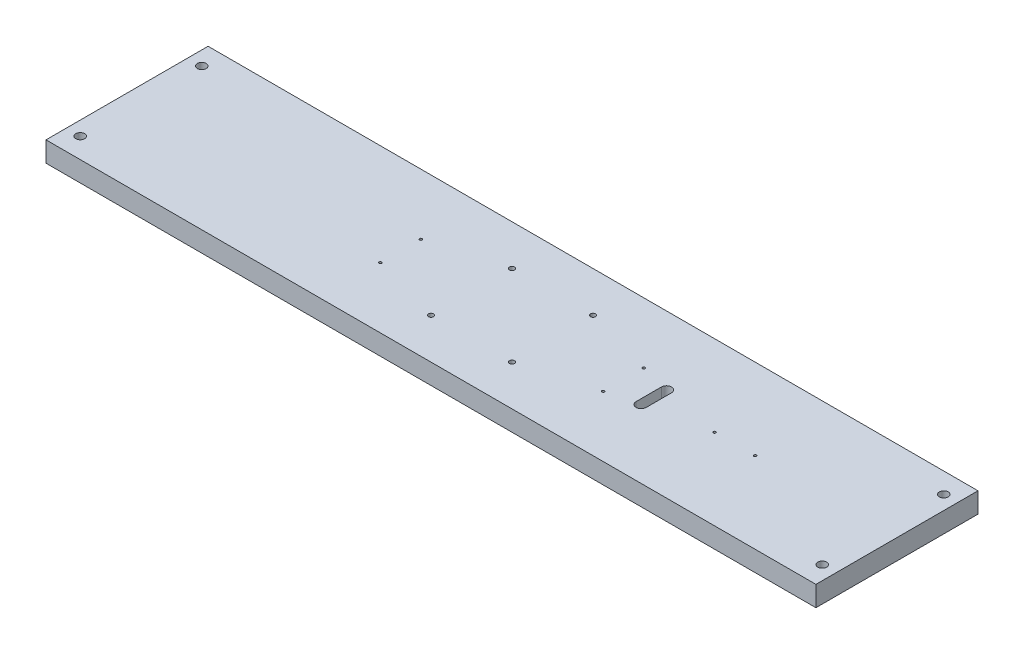
ISO-10303-21;
HEADER;
FILE_DESCRIPTION(('STEP AP214'),'2;1');
FILE_NAME('part.step','',(''),(''),'','','');
FILE_SCHEMA(('AUTOMOTIVE_DESIGN { 1 0 10303 214 1 1 1 1 }'));
ENDSEC;
DATA;
#1=APPLICATION_CONTEXT('core data for automotive mechanical design processes');
#2=APPLICATION_PROTOCOL_DEFINITION('international standard','automotive_design',2000,#1);
#3=PRODUCT_CONTEXT('',#1,'mechanical');
#4=PRODUCT('Part','Part','',(#3));
#5=PRODUCT_RELATED_PRODUCT_CATEGORY('part','',(#4));
#6=PRODUCT_DEFINITION_FORMATION('','',#4);
#7=PRODUCT_DEFINITION_CONTEXT('part definition',#1,'design');
#8=PRODUCT_DEFINITION('design','',#6,#7);
#9=PRODUCT_DEFINITION_SHAPE('','',#8);
#10=(LENGTH_UNIT() NAMED_UNIT(*) SI_UNIT(.MILLI.,.METRE.));
#11=(NAMED_UNIT(*) PLANE_ANGLE_UNIT() SI_UNIT($,.RADIAN.));
#12=(NAMED_UNIT(*) SI_UNIT($,.STERADIAN.) SOLID_ANGLE_UNIT());
#13=UNCERTAINTY_MEASURE_WITH_UNIT(LENGTH_MEASURE(1.E-05),#10,'distance_accuracy_value','');
#14=(GEOMETRIC_REPRESENTATION_CONTEXT(3) GLOBAL_UNCERTAINTY_ASSIGNED_CONTEXT((#13)) GLOBAL_UNIT_ASSIGNED_CONTEXT((#10,
#11,#12)) REPRESENTATION_CONTEXT('',''));
#15=CARTESIAN_POINT('',(0.,0.,0.));
#16=DIRECTION('',(0.,0.,1.));
#17=DIRECTION('',(1.,0.,0.));
#18=AXIS2_PLACEMENT_3D('',#15,#16,#17);
#19=CARTESIAN_POINT('',(241.3,12.7,50.8));
#20=DIRECTION('',(-1.,0.,0.));
#21=DIRECTION('',(0.,0.,1.));
#22=AXIS2_PLACEMENT_3D('',#19,#20,#21);
#23=PLANE('',#22);
#24=DIRECTION('',(0.,0.,-1.));
#25=VECTOR('',#24,1.);
#26=CARTESIAN_POINT('',(241.3,0.,50.8));
#27=LINE('',#26,#25);
#28=CARTESIAN_POINT('',(241.3,0.,50.8));
#29=VERTEX_POINT('',#28);
#30=CARTESIAN_POINT('',(241.3,0.,-50.8));
#31=VERTEX_POINT('',#30);
#32=EDGE_CURVE('E265',#29,#31,#27,.T.);
#33=ORIENTED_EDGE('',*,*,#32,.T.);
#34=DIRECTION('',(0.,-1.,0.));
#35=VECTOR('',#34,1.);
#36=CARTESIAN_POINT('',(241.3,12.7,-50.8));
#37=LINE('',#36,#35);
#38=CARTESIAN_POINT('',(241.3,12.7,-50.8));
#39=VERTEX_POINT('',#38);
#40=EDGE_CURVE('E11',#39,#31,#37,.T.);
#41=ORIENTED_EDGE('',*,*,#40,.F.);
#42=DIRECTION('',(0.,0.,-1.));
#43=VECTOR('',#42,1.);
#44=CARTESIAN_POINT('',(241.3,12.7,50.8));
#45=LINE('',#44,#43);
#46=CARTESIAN_POINT('',(241.3,12.7,50.8));
#47=VERTEX_POINT('',#46);
#48=EDGE_CURVE('E269',#47,#39,#45,.T.);
#49=ORIENTED_EDGE('',*,*,#48,.F.);
#50=DIRECTION('',(0.,-1.,0.));
#51=VECTOR('',#50,1.);
#52=CARTESIAN_POINT('',(241.3,12.7,50.8));
#53=LINE('',#52,#51);
#54=EDGE_CURVE('E283',#47,#29,#53,.T.);
#55=ORIENTED_EDGE('',*,*,#54,.T.);
#56=EDGE_LOOP('',(#33,#41,#49,#55));
#57=FACE_BOUND('',#56,.T.);
#58=ADVANCED_FACE('F43',(#57),#23,.F.);
#59=CARTESIAN_POINT('',(-241.3,12.7,-50.8));
#60=DIRECTION('',(0.,0.,1.));
#61=DIRECTION('',(1.,0.,0.));
#62=AXIS2_PLACEMENT_3D('',#59,#60,#61);
#63=PLANE('',#62);
#64=DIRECTION('',(-1.,0.,0.));
#65=VECTOR('',#64,1.);
#66=CARTESIAN_POINT('',(-241.3,0.,-50.8));
#67=LINE('',#66,#65);
#68=CARTESIAN_POINT('',(-241.3,0.,-50.8));
#69=VERTEX_POINT('',#68);
#70=EDGE_CURVE('E287',#31,#69,#67,.T.);
#71=ORIENTED_EDGE('',*,*,#70,.T.);
#72=DIRECTION('',(0.,-1.,0.));
#73=VECTOR('',#72,1.);
#74=CARTESIAN_POINT('',(-241.3,12.7,-50.8));
#75=LINE('',#74,#73);
#76=CARTESIAN_POINT('',(-241.3,12.7,-50.8));
#77=VERTEX_POINT('',#76);
#78=EDGE_CURVE('E51',#77,#69,#75,.T.);
#79=ORIENTED_EDGE('',*,*,#78,.F.);
#80=DIRECTION('',(-1.,0.,0.));
#81=VECTOR('',#80,1.);
#82=CARTESIAN_POINT('',(-241.3,12.7,-50.8));
#83=LINE('',#82,#81);
#84=EDGE_CURVE('E273',#39,#77,#83,.T.);
#85=ORIENTED_EDGE('',*,*,#84,.F.);
#86=ORIENTED_EDGE('',*,*,#40,.T.);
#87=EDGE_LOOP('',(#71,#79,#85,#86));
#88=FACE_BOUND('',#87,.T.);
#89=ADVANCED_FACE('F322',(#88),#63,.F.);
#90=CARTESIAN_POINT('',(-241.3,12.7,50.8));
#91=DIRECTION('',(1.,0.,0.));
#92=DIRECTION('',(0.,0.,-1.));
#93=AXIS2_PLACEMENT_3D('',#90,#91,#92);
#94=PLANE('',#93);
#95=DIRECTION('',(0.,0.,1.));
#96=VECTOR('',#95,1.);
#97=CARTESIAN_POINT('',(-241.3,0.,50.8));
#98=LINE('',#97,#96);
#99=CARTESIAN_POINT('',(-241.3,0.,50.8));
#100=VERTEX_POINT('',#99);
#101=EDGE_CURVE('E290',#69,#100,#98,.T.);
#102=ORIENTED_EDGE('',*,*,#101,.T.);
#103=DIRECTION('',(0.,-1.,0.));
#104=VECTOR('',#103,1.);
#105=CARTESIAN_POINT('',(-241.3,12.7,50.8));
#106=LINE('',#105,#104);
#107=CARTESIAN_POINT('',(-241.3,12.7,50.8));
#108=VERTEX_POINT('',#107);
#109=EDGE_CURVE('E298',#108,#100,#106,.T.);
#110=ORIENTED_EDGE('',*,*,#109,.F.);
#111=DIRECTION('',(0.,0.,1.));
#112=VECTOR('',#111,1.);
#113=CARTESIAN_POINT('',(-241.3,12.7,50.8));
#114=LINE('',#113,#112);
#115=EDGE_CURVE('E277',#77,#108,#114,.T.);
#116=ORIENTED_EDGE('',*,*,#115,.F.);
#117=ORIENTED_EDGE('',*,*,#78,.T.);
#118=EDGE_LOOP('',(#102,#110,#116,#117));
#119=FACE_BOUND('',#118,.T.);
#120=ADVANCED_FACE('F307',(#119),#94,.F.);
#121=CARTESIAN_POINT('',(-241.3,12.7,50.8));
#122=DIRECTION('',(0.,0.,-1.));
#123=DIRECTION('',(-1.,0.,0.));
#124=AXIS2_PLACEMENT_3D('',#121,#122,#123);
#125=PLANE('',#124);
#126=DIRECTION('',(1.,0.,0.));
#127=VECTOR('',#126,1.);
#128=CARTESIAN_POINT('',(-241.3,0.,50.8));
#129=LINE('',#128,#127);
#130=EDGE_CURVE('E274',#100,#29,#129,.T.);
#131=ORIENTED_EDGE('',*,*,#130,.T.);
#132=ORIENTED_EDGE('',*,*,#54,.F.);
#133=DIRECTION('',(1.,0.,0.));
#134=VECTOR('',#133,1.);
#135=CARTESIAN_POINT('',(-241.3,12.7,50.8));
#136=LINE('',#135,#134);
#137=EDGE_CURVE('E280',#108,#47,#136,.T.);
#138=ORIENTED_EDGE('',*,*,#137,.F.);
#139=ORIENTED_EDGE('',*,*,#109,.T.);
#140=EDGE_LOOP('',(#131,#132,#138,#139));
#141=FACE_BOUND('',#140,.T.);
#142=ADVANCED_FACE('F315',(#141),#125,.F.);
#143=CARTESIAN_POINT('',(0.,12.7,0.));
#144=DIRECTION('',(0.,-1.,0.));
#145=DIRECTION('',(0.,0.,-1.));
#146=AXIS2_PLACEMENT_3D('',#143,#144,#145);
#147=PLANE('',#146);
#148=DIRECTION('',(0.,0.,1.));
#149=VECTOR('',#148,1.);
#150=CARTESIAN_POINT('',(85.725,12.7,-7.9375));
#151=LINE('',#150,#149);
#152=CARTESIAN_POINT('',(85.725,12.7,-7.9375));
#153=VERTEX_POINT('',#152);
#154=CARTESIAN_POINT('',(85.725,12.7,7.9375));
#155=VERTEX_POINT('',#154);
#156=EDGE_CURVE('E142',#153,#155,#151,.T.);
#157=ORIENTED_EDGE('',*,*,#156,.F.);
#158=CARTESIAN_POINT('',(88.9,12.7,-7.9375));
#159=DIRECTION('',(0.,1.,0.));
#160=DIRECTION('',(0.,0.,1.));
#161=AXIS2_PLACEMENT_3D('',#158,#159,#160);
#162=CIRCLE('',#161,3.17499999999999);
#163=CARTESIAN_POINT('',(92.075,12.7,-7.9375));
#164=VERTEX_POINT('',#163);
#165=EDGE_CURVE('E58',#164,#153,#162,.T.);
#166=ORIENTED_EDGE('',*,*,#165,.F.);
#167=DIRECTION('',(0.,0.,-1.));
#168=VECTOR('',#167,1.);
#169=CARTESIAN_POINT('',(92.075,12.7,-7.9375));
#170=LINE('',#169,#168);
#171=CARTESIAN_POINT('',(92.075,12.7,7.9375));
#172=VERTEX_POINT('',#171);
#173=EDGE_CURVE('E129',#172,#164,#170,.T.);
#174=ORIENTED_EDGE('',*,*,#173,.F.);
#175=CARTESIAN_POINT('',(88.9,12.7,7.9375));
#176=DIRECTION('',(0.,1.,0.));
#177=DIRECTION('',(0.,0.,1.));
#178=AXIS2_PLACEMENT_3D('',#175,#176,#177);
#179=CIRCLE('',#178,3.17499999999999);
#180=EDGE_CURVE('E133',#155,#172,#179,.T.);
#181=ORIENTED_EDGE('',*,*,#180,.F.);
#182=EDGE_LOOP('',(#157,#166,#174,#181));
#183=FACE_BOUND('',#182,.T.);
#184=CARTESIAN_POINT('',(127.,12.7,0.));
#185=DIRECTION('',(0.,1.,0.));
#186=DIRECTION('',(0.,0.,1.));
#187=AXIS2_PLACEMENT_3D('',#184,#185,#186);
#188=CIRCLE('',#187,0.79375000000002);
#189=CARTESIAN_POINT('',(127.,12.7,0.79375000000002));
#190=VERTEX_POINT('',#189);
#191=EDGE_CURVE('E162',#190,#190,#188,.T.);
#192=ORIENTED_EDGE('',*,*,#191,.F.);
#193=EDGE_LOOP('',(#192));
#194=FACE_BOUND('',#193,.T.);
#195=CARTESIAN_POINT('',(152.4,12.7,0.));
#196=DIRECTION('',(0.,1.,0.));
#197=DIRECTION('',(0.,0.,1.));
#198=AXIS2_PLACEMENT_3D('',#195,#196,#197);
#199=CIRCLE('',#198,0.793749999999991);
#200=CARTESIAN_POINT('',(152.4,12.7,0.793749999999991));
#201=VERTEX_POINT('',#200);
#202=EDGE_CURVE('E166',#201,#201,#199,.T.);
#203=ORIENTED_EDGE('',*,*,#202,.F.);
#204=EDGE_LOOP('',(#203));
#205=FACE_BOUND('',#204,.T.);
#206=CARTESIAN_POINT('',(69.85,12.7,-12.7));
#207=DIRECTION('',(0.,1.,0.));
#208=DIRECTION('',(0.,0.,1.));
#209=AXIS2_PLACEMENT_3D('',#206,#207,#208);
#210=CIRCLE('',#209,0.793749999999993);
#211=CARTESIAN_POINT('',(69.85,12.7,-11.90625));
#212=VERTEX_POINT('',#211);
#213=EDGE_CURVE('E190',#212,#212,#210,.T.);
#214=ORIENTED_EDGE('',*,*,#213,.F.);
#215=EDGE_LOOP('',(#214));
#216=FACE_BOUND('',#215,.T.);
#217=CARTESIAN_POINT('',(69.85,12.7,12.7));
#218=DIRECTION('',(0.,1.,0.));
#219=DIRECTION('',(0.,0.,1.));
#220=AXIS2_PLACEMENT_3D('',#217,#218,#219);
#221=CIRCLE('',#220,0.793749999999993);
#222=CARTESIAN_POINT('',(69.85,12.7,13.49375));
#223=VERTEX_POINT('',#222);
#224=EDGE_CURVE('E182',#223,#223,#221,.T.);
#225=ORIENTED_EDGE('',*,*,#224,.F.);
#226=EDGE_LOOP('',(#225));
#227=FACE_BOUND('',#226,.T.);
#228=CARTESIAN_POINT('',(-69.85,12.7,12.7));
#229=DIRECTION('',(0.,1.,0.));
#230=DIRECTION('',(0.,0.,1.));
#231=AXIS2_PLACEMENT_3D('',#228,#229,#230);
#232=CIRCLE('',#231,0.793749999999993);
#233=CARTESIAN_POINT('',(-69.85,12.7,13.49375));
#234=VERTEX_POINT('',#233);
#235=EDGE_CURVE('E173',#234,#234,#232,.T.);
#236=ORIENTED_EDGE('',*,*,#235,.F.);
#237=EDGE_LOOP('',(#236));
#238=FACE_BOUND('',#237,.T.);
#239=CARTESIAN_POINT('',(-69.85,12.7,-12.7));
#240=DIRECTION('',(0.,1.,0.));
#241=DIRECTION('',(0.,0.,1.));
#242=AXIS2_PLACEMENT_3D('',#239,#240,#241);
#243=CIRCLE('',#242,0.793749999999993);
#244=CARTESIAN_POINT('',(-69.85,12.7,-11.90625));
#245=VERTEX_POINT('',#244);
#246=EDGE_CURVE('E177',#245,#245,#243,.T.);
#247=ORIENTED_EDGE('',*,*,#246,.F.);
#248=EDGE_LOOP('',(#247));
#249=FACE_BOUND('',#248,.T.);
#250=CARTESIAN_POINT('',(-25.4,12.7,25.4));
#251=DIRECTION('',(0.,1.,0.));
#252=DIRECTION('',(0.,0.,1.));
#253=AXIS2_PLACEMENT_3D('',#250,#251,#252);
#254=CIRCLE('',#253,1.5875);
#255=CARTESIAN_POINT('',(-25.4,12.7,26.9875));
#256=VERTEX_POINT('',#255);
#257=EDGE_CURVE('E222',#256,#256,#254,.T.);
#258=ORIENTED_EDGE('',*,*,#257,.F.);
#259=EDGE_LOOP('',(#258));
#260=FACE_BOUND('',#259,.T.);
#261=CARTESIAN_POINT('',(25.4,12.7,25.4));
#262=DIRECTION('',(0.,1.,0.));
#263=DIRECTION('',(0.,0.,1.));
#264=AXIS2_PLACEMENT_3D('',#261,#262,#263);
#265=CIRCLE('',#264,1.5875);
#266=CARTESIAN_POINT('',(25.4,12.7,26.9875));
#267=VERTEX_POINT('',#266);
#268=EDGE_CURVE('E214',#267,#267,#265,.T.);
#269=ORIENTED_EDGE('',*,*,#268,.F.);
#270=EDGE_LOOP('',(#269));
#271=FACE_BOUND('',#270,.T.);
#272=CARTESIAN_POINT('',(25.4,12.7,-25.4));
#273=DIRECTION('',(0.,1.,0.));
#274=DIRECTION('',(0.,0.,1.));
#275=AXIS2_PLACEMENT_3D('',#272,#273,#274);
#276=CIRCLE('',#275,1.5875);
#277=CARTESIAN_POINT('',(25.4,12.7,-23.8125));
#278=VERTEX_POINT('',#277);
#279=EDGE_CURVE('E205',#278,#278,#276,.T.);
#280=ORIENTED_EDGE('',*,*,#279,.F.);
#281=EDGE_LOOP('',(#280));
#282=FACE_BOUND('',#281,.T.);
#283=CARTESIAN_POINT('',(-25.4,12.7,-25.4));
#284=DIRECTION('',(0.,1.,0.));
#285=DIRECTION('',(0.,0.,1.));
#286=AXIS2_PLACEMENT_3D('',#283,#284,#285);
#287=CIRCLE('',#286,1.5875);
#288=CARTESIAN_POINT('',(-25.4,12.7,-23.8125));
#289=VERTEX_POINT('',#288);
#290=EDGE_CURVE('E209',#289,#289,#287,.T.);
#291=ORIENTED_EDGE('',*,*,#290,.F.);
#292=EDGE_LOOP('',(#291));
#293=FACE_BOUND('',#292,.T.);
#294=CARTESIAN_POINT('',(-232.5624,12.7,38.1));
#295=DIRECTION('',(0.,1.,0.));
#296=DIRECTION('',(0.,0.,1.));
#297=AXIS2_PLACEMENT_3D('',#294,#295,#296);
#298=CIRCLE('',#297,2.78129999999998);
#299=CARTESIAN_POINT('',(-232.5624,12.7,40.8813));
#300=VERTEX_POINT('',#299);
#301=EDGE_CURVE('E245',#300,#300,#298,.T.);
#302=ORIENTED_EDGE('',*,*,#301,.F.);
#303=EDGE_LOOP('',(#302));
#304=FACE_BOUND('',#303,.T.);
#305=CARTESIAN_POINT('',(232.5624,12.7,-38.1000000000001));
#306=DIRECTION('',(0.,1.,0.));
#307=DIRECTION('',(0.,0.,1.));
#308=AXIS2_PLACEMENT_3D('',#305,#306,#307);
#309=CIRCLE('',#308,2.78129999999998);
#310=CARTESIAN_POINT('',(232.5624,12.7,-35.3187000000001));
#311=VERTEX_POINT('',#310);
#312=EDGE_CURVE('E254',#311,#311,#309,.T.);
#313=ORIENTED_EDGE('',*,*,#312,.F.);
#314=EDGE_LOOP('',(#313));
#315=FACE_BOUND('',#314,.T.);
#316=CARTESIAN_POINT('',(232.5624,12.7,38.1));
#317=DIRECTION('',(0.,1.,0.));
#318=DIRECTION('',(0.,0.,1.));
#319=AXIS2_PLACEMENT_3D('',#316,#317,#318);
#320=CIRCLE('',#319,2.78129999999998);
#321=CARTESIAN_POINT('',(232.5624,12.7,40.8812999999999));
#322=VERTEX_POINT('',#321);
#323=EDGE_CURVE('E237',#322,#322,#320,.T.);
#324=ORIENTED_EDGE('',*,*,#323,.F.);
#325=EDGE_LOOP('',(#324));
#326=FACE_BOUND('',#325,.T.);
#327=CARTESIAN_POINT('',(-232.5624,12.7,-38.1));
#328=DIRECTION('',(0.,1.,0.));
#329=DIRECTION('',(0.,0.,1.));
#330=AXIS2_PLACEMENT_3D('',#327,#328,#329);
#331=CIRCLE('',#330,2.78129999999998);
#332=CARTESIAN_POINT('',(-232.5624,12.7,-35.3187));
#333=VERTEX_POINT('',#332);
#334=EDGE_CURVE('E249',#333,#333,#331,.T.);
#335=ORIENTED_EDGE('',*,*,#334,.F.);
#336=EDGE_LOOP('',(#335));
#337=FACE_BOUND('',#336,.T.);
#338=ORIENTED_EDGE('',*,*,#48,.T.);
#339=ORIENTED_EDGE('',*,*,#84,.T.);
#340=ORIENTED_EDGE('',*,*,#115,.T.);
#341=ORIENTED_EDGE('',*,*,#137,.T.);
#342=EDGE_LOOP('',(#338,#339,#340,#341));
#343=FACE_BOUND('',#342,.T.);
#344=ADVANCED_FACE('F321',(#183,#194,#205,#216,#227,#238,#249,#260,#271,#282,#293,#304,#315,
#326,#337,#343),#147,.F.);
#345=CARTESIAN_POINT('',(0.,0.,0.));
#346=DIRECTION('',(0.,-1.,0.));
#347=DIRECTION('',(0.,0.,-1.));
#348=AXIS2_PLACEMENT_3D('',#345,#346,#347);
#349=PLANE('',#348);
#350=CARTESIAN_POINT('',(88.9,0.,-7.9375));
#351=DIRECTION('',(0.,1.,0.));
#352=DIRECTION('',(0.,0.,1.));
#353=AXIS2_PLACEMENT_3D('',#350,#351,#352);
#354=CIRCLE('',#353,3.17499999999999);
#355=CARTESIAN_POINT('',(92.075,0.,-7.9375));
#356=VERTEX_POINT('',#355);
#357=CARTESIAN_POINT('',(85.725,0.,-7.9375));
#358=VERTEX_POINT('',#357);
#359=EDGE_CURVE('E110',#356,#358,#354,.T.);
#360=ORIENTED_EDGE('',*,*,#359,.T.);
#361=DIRECTION('',(0.,0.,1.));
#362=VECTOR('',#361,1.);
#363=CARTESIAN_POINT('',(85.725,0.,-7.9375));
#364=LINE('',#363,#362);
#365=CARTESIAN_POINT('',(85.725,0.,7.9375));
#366=VERTEX_POINT('',#365);
#367=EDGE_CURVE('E120',#358,#366,#364,.T.);
#368=ORIENTED_EDGE('',*,*,#367,.T.);
#369=CARTESIAN_POINT('',(88.9,0.,7.9375));
#370=DIRECTION('',(0.,1.,0.));
#371=DIRECTION('',(0.,0.,1.));
#372=AXIS2_PLACEMENT_3D('',#369,#370,#371);
#373=CIRCLE('',#372,3.17499999999999);
#374=CARTESIAN_POINT('',(92.075,0.,7.9375));
#375=VERTEX_POINT('',#374);
#376=EDGE_CURVE('E66',#366,#375,#373,.T.);
#377=ORIENTED_EDGE('',*,*,#376,.T.);
#378=DIRECTION('',(0.,0.,-1.));
#379=VECTOR('',#378,1.);
#380=CARTESIAN_POINT('',(92.075,0.,-7.9375));
#381=LINE('',#380,#379);
#382=EDGE_CURVE('E117',#375,#356,#381,.T.);
#383=ORIENTED_EDGE('',*,*,#382,.T.);
#384=EDGE_LOOP('',(#360,#368,#377,#383));
#385=FACE_BOUND('',#384,.T.);
#386=CARTESIAN_POINT('',(127.,0.,0.));
#387=DIRECTION('',(0.,1.,0.));
#388=DIRECTION('',(0.,0.,1.));
#389=AXIS2_PLACEMENT_3D('',#386,#387,#388);
#390=CIRCLE('',#389,0.79375000000002);
#391=CARTESIAN_POINT('',(127.,0.,0.79375000000002));
#392=VERTEX_POINT('',#391);
#393=EDGE_CURVE('E157',#392,#392,#390,.T.);
#394=ORIENTED_EDGE('',*,*,#393,.T.);
#395=EDGE_LOOP('',(#394));
#396=FACE_BOUND('',#395,.T.);
#397=CARTESIAN_POINT('',(152.4,0.,0.));
#398=DIRECTION('',(0.,1.,0.));
#399=DIRECTION('',(0.,0.,1.));
#400=AXIS2_PLACEMENT_3D('',#397,#398,#399);
#401=CIRCLE('',#400,0.793749999999991);
#402=CARTESIAN_POINT('',(152.4,0.,0.793749999999991));
#403=VERTEX_POINT('',#402);
#404=EDGE_CURVE('E151',#403,#403,#401,.T.);
#405=ORIENTED_EDGE('',*,*,#404,.T.);
#406=EDGE_LOOP('',(#405));
#407=FACE_BOUND('',#406,.T.);
#408=CARTESIAN_POINT('',(69.85,0.,-12.7));
#409=DIRECTION('',(0.,1.,0.));
#410=DIRECTION('',(0.,0.,1.));
#411=AXIS2_PLACEMENT_3D('',#408,#409,#410);
#412=CIRCLE('',#411,0.793749999999993);
#413=CARTESIAN_POINT('',(69.85,0.,-11.90625));
#414=VERTEX_POINT('',#413);
#415=EDGE_CURVE('E161',#414,#414,#412,.T.);
#416=ORIENTED_EDGE('',*,*,#415,.T.);
#417=EDGE_LOOP('',(#416));
#418=FACE_BOUND('',#417,.T.);
#419=CARTESIAN_POINT('',(69.85,0.,12.7));
#420=DIRECTION('',(0.,1.,0.));
#421=DIRECTION('',(0.,0.,1.));
#422=AXIS2_PLACEMENT_3D('',#419,#420,#421);
#423=CIRCLE('',#422,0.793749999999993);
#424=CARTESIAN_POINT('',(69.85,0.,13.49375));
#425=VERTEX_POINT('',#424);
#426=EDGE_CURVE('E186',#425,#425,#423,.T.);
#427=ORIENTED_EDGE('',*,*,#426,.T.);
#428=EDGE_LOOP('',(#427));
#429=FACE_BOUND('',#428,.T.);
#430=CARTESIAN_POINT('',(-69.85,0.,12.7));
#431=DIRECTION('',(0.,1.,0.));
#432=DIRECTION('',(0.,0.,1.));
#433=AXIS2_PLACEMENT_3D('',#430,#431,#432);
#434=CIRCLE('',#433,0.793749999999993);
#435=CARTESIAN_POINT('',(-69.85,0.,13.49375));
#436=VERTEX_POINT('',#435);
#437=EDGE_CURVE('E178',#436,#436,#434,.T.);
#438=ORIENTED_EDGE('',*,*,#437,.T.);
#439=EDGE_LOOP('',(#438));
#440=FACE_BOUND('',#439,.T.);
#441=CARTESIAN_POINT('',(-69.85,0.,-12.7));
#442=DIRECTION('',(0.,1.,0.));
#443=DIRECTION('',(0.,0.,1.));
#444=AXIS2_PLACEMENT_3D('',#441,#442,#443);
#445=CIRCLE('',#444,0.793749999999993);
#446=CARTESIAN_POINT('',(-69.85,0.,-11.90625));
#447=VERTEX_POINT('',#446);
#448=EDGE_CURVE('E197',#447,#447,#445,.T.);
#449=ORIENTED_EDGE('',*,*,#448,.T.);
#450=EDGE_LOOP('',(#449));
#451=FACE_BOUND('',#450,.T.);
#452=CARTESIAN_POINT('',(-25.4,0.,25.4));
#453=DIRECTION('',(0.,1.,0.));
#454=DIRECTION('',(0.,0.,1.));
#455=AXIS2_PLACEMENT_3D('',#452,#453,#454);
#456=CIRCLE('',#455,1.5875);
#457=CARTESIAN_POINT('',(-25.4,0.,26.9875));
#458=VERTEX_POINT('',#457);
#459=EDGE_CURVE('E201',#458,#458,#456,.T.);
#460=ORIENTED_EDGE('',*,*,#459,.T.);
#461=EDGE_LOOP('',(#460));
#462=FACE_BOUND('',#461,.T.);
#463=CARTESIAN_POINT('',(25.4,0.,25.4));
#464=DIRECTION('',(0.,1.,0.));
#465=DIRECTION('',(0.,0.,1.));
#466=AXIS2_PLACEMENT_3D('',#463,#464,#465);
#467=CIRCLE('',#466,1.5875);
#468=CARTESIAN_POINT('',(25.4,0.,26.9875));
#469=VERTEX_POINT('',#468);
#470=EDGE_CURVE('E218',#469,#469,#467,.T.);
#471=ORIENTED_EDGE('',*,*,#470,.T.);
#472=EDGE_LOOP('',(#471));
#473=FACE_BOUND('',#472,.T.);
#474=CARTESIAN_POINT('',(25.4,0.,-25.4));
#475=DIRECTION('',(0.,1.,0.));
#476=DIRECTION('',(0.,0.,1.));
#477=AXIS2_PLACEMENT_3D('',#474,#475,#476);
#478=CIRCLE('',#477,1.5875);
#479=CARTESIAN_POINT('',(25.4,0.,-23.8125));
#480=VERTEX_POINT('',#479);
#481=EDGE_CURVE('E210',#480,#480,#478,.T.);
#482=ORIENTED_EDGE('',*,*,#481,.T.);
#483=EDGE_LOOP('',(#482));
#484=FACE_BOUND('',#483,.T.);
#485=CARTESIAN_POINT('',(-25.4,0.,-25.4));
#486=DIRECTION('',(0.,1.,0.));
#487=DIRECTION('',(0.,0.,1.));
#488=AXIS2_PLACEMENT_3D('',#485,#486,#487);
#489=CIRCLE('',#488,1.5875);
#490=CARTESIAN_POINT('',(-25.4,0.,-23.8125));
#491=VERTEX_POINT('',#490);
#492=EDGE_CURVE('E229',#491,#491,#489,.T.);
#493=ORIENTED_EDGE('',*,*,#492,.T.);
#494=EDGE_LOOP('',(#493));
#495=FACE_BOUND('',#494,.T.);
#496=CARTESIAN_POINT('',(-232.5624,0.,38.1));
#497=DIRECTION('',(0.,1.,0.));
#498=DIRECTION('',(0.,0.,1.));
#499=AXIS2_PLACEMENT_3D('',#496,#497,#498);
#500=CIRCLE('',#499,2.78129999999998);
#501=CARTESIAN_POINT('',(-232.5624,0.,40.8813));
#502=VERTEX_POINT('',#501);
#503=EDGE_CURVE('E250',#502,#502,#500,.T.);
#504=ORIENTED_EDGE('',*,*,#503,.T.);
#505=EDGE_LOOP('',(#504));
#506=FACE_BOUND('',#505,.T.);
#507=CARTESIAN_POINT('',(232.5624,0.,-38.1000000000001));
#508=DIRECTION('',(0.,1.,0.));
#509=DIRECTION('',(0.,0.,1.));
#510=AXIS2_PLACEMENT_3D('',#507,#508,#509);
#511=CIRCLE('',#510,2.78129999999998);
#512=CARTESIAN_POINT('',(232.5624,0.,-35.3187000000001));
#513=VERTEX_POINT('',#512);
#514=EDGE_CURVE('E241',#513,#513,#511,.T.);
#515=ORIENTED_EDGE('',*,*,#514,.T.);
#516=EDGE_LOOP('',(#515));
#517=FACE_BOUND('',#516,.T.);
#518=CARTESIAN_POINT('',(232.5624,0.,38.1));
#519=DIRECTION('',(0.,1.,0.));
#520=DIRECTION('',(0.,0.,1.));
#521=AXIS2_PLACEMENT_3D('',#518,#519,#520);
#522=CIRCLE('',#521,2.78129999999998);
#523=CARTESIAN_POINT('',(232.5624,0.,40.8812999999999));
#524=VERTEX_POINT('',#523);
#525=EDGE_CURVE('E233',#524,#524,#522,.T.);
#526=ORIENTED_EDGE('',*,*,#525,.T.);
#527=EDGE_LOOP('',(#526));
#528=FACE_BOUND('',#527,.T.);
#529=CARTESIAN_POINT('',(-232.5624,0.,-38.1));
#530=DIRECTION('',(0.,1.,0.));
#531=DIRECTION('',(0.,0.,1.));
#532=AXIS2_PLACEMENT_3D('',#529,#530,#531);
#533=CIRCLE('',#532,2.78129999999998);
#534=CARTESIAN_POINT('',(-232.5624,0.,-35.3187));
#535=VERTEX_POINT('',#534);
#536=EDGE_CURVE('E261',#535,#535,#533,.T.);
#537=ORIENTED_EDGE('',*,*,#536,.T.);
#538=EDGE_LOOP('',(#537));
#539=FACE_BOUND('',#538,.T.);
#540=ORIENTED_EDGE('',*,*,#32,.F.);
#541=ORIENTED_EDGE('',*,*,#130,.F.);
#542=ORIENTED_EDGE('',*,*,#101,.F.);
#543=ORIENTED_EDGE('',*,*,#70,.F.);
#544=EDGE_LOOP('',(#540,#541,#542,#543));
#545=FACE_BOUND('',#544,.T.);
#546=ADVANCED_FACE('F125',(#385,#396,#407,#418,#429,#440,#451,#462,#473,#484,#495,#506,#517,
#528,#539,#545),#349,.T.);
#547=CARTESIAN_POINT('',(-232.5624,0.,-38.1));
#548=DIRECTION('',(0.,1.,0.));
#549=DIRECTION('',(0.,0.,1.));
#550=AXIS2_PLACEMENT_3D('',#547,#548,#549);
#551=CYLINDRICAL_SURFACE('',#550,2.78129999999998);
#552=ORIENTED_EDGE('',*,*,#536,.F.);
#553=EDGE_LOOP('',(#552));
#554=FACE_BOUND('',#553,.T.);
#555=ORIENTED_EDGE('',*,*,#334,.T.);
#556=EDGE_LOOP('',(#555));
#557=FACE_BOUND('',#556,.T.);
#558=ADVANCED_FACE('F334',(#554,#557),#551,.F.);
#559=CARTESIAN_POINT('',(232.5624,0.,38.1));
#560=DIRECTION('',(0.,1.,0.));
#561=DIRECTION('',(0.,0.,1.));
#562=AXIS2_PLACEMENT_3D('',#559,#560,#561);
#563=CYLINDRICAL_SURFACE('',#562,2.78129999999998);
#564=ORIENTED_EDGE('',*,*,#525,.F.);
#565=EDGE_LOOP('',(#564));
#566=FACE_BOUND('',#565,.T.);
#567=ORIENTED_EDGE('',*,*,#323,.T.);
#568=EDGE_LOOP('',(#567));
#569=FACE_BOUND('',#568,.T.);
#570=ADVANCED_FACE('F340',(#566,#569),#563,.F.);
#571=CARTESIAN_POINT('',(232.5624,0.,-38.1000000000001));
#572=DIRECTION('',(0.,1.,0.));
#573=DIRECTION('',(0.,0.,1.));
#574=AXIS2_PLACEMENT_3D('',#571,#572,#573);
#575=CYLINDRICAL_SURFACE('',#574,2.78129999999998);
#576=ORIENTED_EDGE('',*,*,#514,.F.);
#577=EDGE_LOOP('',(#576));
#578=FACE_BOUND('',#577,.T.);
#579=ORIENTED_EDGE('',*,*,#312,.T.);
#580=EDGE_LOOP('',(#579));
#581=FACE_BOUND('',#580,.T.);
#582=ADVANCED_FACE('F342',(#578,#581),#575,.F.);
#583=CARTESIAN_POINT('',(-232.5624,0.,38.1));
#584=DIRECTION('',(0.,1.,0.));
#585=DIRECTION('',(0.,0.,1.));
#586=AXIS2_PLACEMENT_3D('',#583,#584,#585);
#587=CYLINDRICAL_SURFACE('',#586,2.78129999999998);
#588=ORIENTED_EDGE('',*,*,#503,.F.);
#589=EDGE_LOOP('',(#588));
#590=FACE_BOUND('',#589,.T.);
#591=ORIENTED_EDGE('',*,*,#301,.T.);
#592=EDGE_LOOP('',(#591));
#593=FACE_BOUND('',#592,.T.);
#594=ADVANCED_FACE('F345',(#590,#593),#587,.F.);
#595=CARTESIAN_POINT('',(-25.4,0.,-25.4));
#596=DIRECTION('',(0.,1.,0.));
#597=DIRECTION('',(0.,0.,1.));
#598=AXIS2_PLACEMENT_3D('',#595,#596,#597);
#599=CYLINDRICAL_SURFACE('',#598,1.5875);
#600=ORIENTED_EDGE('',*,*,#492,.F.);
#601=EDGE_LOOP('',(#600));
#602=FACE_BOUND('',#601,.T.);
#603=ORIENTED_EDGE('',*,*,#290,.T.);
#604=EDGE_LOOP('',(#603));
#605=FACE_BOUND('',#604,.T.);
#606=ADVANCED_FACE('F349',(#602,#605),#599,.F.);
#607=CARTESIAN_POINT('',(25.4,0.,-25.4));
#608=DIRECTION('',(0.,1.,0.));
#609=DIRECTION('',(0.,0.,1.));
#610=AXIS2_PLACEMENT_3D('',#607,#608,#609);
#611=CYLINDRICAL_SURFACE('',#610,1.5875);
#612=ORIENTED_EDGE('',*,*,#481,.F.);
#613=EDGE_LOOP('',(#612));
#614=FACE_BOUND('',#613,.T.);
#615=ORIENTED_EDGE('',*,*,#279,.T.);
#616=EDGE_LOOP('',(#615));
#617=FACE_BOUND('',#616,.T.);
#618=ADVANCED_FACE('F356',(#614,#617),#611,.F.);
#619=CARTESIAN_POINT('',(25.4,0.,25.4));
#620=DIRECTION('',(0.,1.,0.));
#621=DIRECTION('',(0.,0.,1.));
#622=AXIS2_PLACEMENT_3D('',#619,#620,#621);
#623=CYLINDRICAL_SURFACE('',#622,1.5875);
#624=ORIENTED_EDGE('',*,*,#470,.F.);
#625=EDGE_LOOP('',(#624));
#626=FACE_BOUND('',#625,.T.);
#627=ORIENTED_EDGE('',*,*,#268,.T.);
#628=EDGE_LOOP('',(#627));
#629=FACE_BOUND('',#628,.T.);
#630=ADVANCED_FACE('F362',(#626,#629),#623,.F.);
#631=CARTESIAN_POINT('',(-25.4,0.,25.4));
#632=DIRECTION('',(0.,1.,0.));
#633=DIRECTION('',(0.,0.,1.));
#634=AXIS2_PLACEMENT_3D('',#631,#632,#633);
#635=CYLINDRICAL_SURFACE('',#634,1.5875);
#636=ORIENTED_EDGE('',*,*,#459,.F.);
#637=EDGE_LOOP('',(#636));
#638=FACE_BOUND('',#637,.T.);
#639=ORIENTED_EDGE('',*,*,#257,.T.);
#640=EDGE_LOOP('',(#639));
#641=FACE_BOUND('',#640,.T.);
#642=ADVANCED_FACE('F358',(#638,#641),#635,.F.);
#643=CARTESIAN_POINT('',(-69.85,0.,-12.7));
#644=DIRECTION('',(0.,1.,0.));
#645=DIRECTION('',(0.,0.,1.));
#646=AXIS2_PLACEMENT_3D('',#643,#644,#645);
#647=CYLINDRICAL_SURFACE('',#646,0.793749999999993);
#648=ORIENTED_EDGE('',*,*,#448,.F.);
#649=EDGE_LOOP('',(#648));
#650=FACE_BOUND('',#649,.T.);
#651=ORIENTED_EDGE('',*,*,#246,.T.);
#652=EDGE_LOOP('',(#651));
#653=FACE_BOUND('',#652,.T.);
#654=ADVANCED_FACE('F361',(#650,#653),#647,.F.);
#655=CARTESIAN_POINT('',(-69.85,0.,12.7));
#656=DIRECTION('',(0.,1.,0.));
#657=DIRECTION('',(0.,0.,1.));
#658=AXIS2_PLACEMENT_3D('',#655,#656,#657);
#659=CYLINDRICAL_SURFACE('',#658,0.793749999999993);
#660=ORIENTED_EDGE('',*,*,#437,.F.);
#661=EDGE_LOOP('',(#660));
#662=FACE_BOUND('',#661,.T.);
#663=ORIENTED_EDGE('',*,*,#235,.T.);
#664=EDGE_LOOP('',(#663));
#665=FACE_BOUND('',#664,.T.);
#666=ADVANCED_FACE('F372',(#662,#665),#659,.F.);
#667=CARTESIAN_POINT('',(69.85,0.,12.7));
#668=DIRECTION('',(0.,1.,0.));
#669=DIRECTION('',(0.,0.,1.));
#670=AXIS2_PLACEMENT_3D('',#667,#668,#669);
#671=CYLINDRICAL_SURFACE('',#670,0.793749999999993);
#672=ORIENTED_EDGE('',*,*,#426,.F.);
#673=EDGE_LOOP('',(#672));
#674=FACE_BOUND('',#673,.T.);
#675=ORIENTED_EDGE('',*,*,#224,.T.);
#676=EDGE_LOOP('',(#675));
#677=FACE_BOUND('',#676,.T.);
#678=ADVANCED_FACE('F378',(#674,#677),#671,.F.);
#679=CARTESIAN_POINT('',(69.85,0.,-12.7));
#680=DIRECTION('',(0.,1.,0.));
#681=DIRECTION('',(0.,0.,1.));
#682=AXIS2_PLACEMENT_3D('',#679,#680,#681);
#683=CYLINDRICAL_SURFACE('',#682,0.793749999999993);
#684=ORIENTED_EDGE('',*,*,#415,.F.);
#685=EDGE_LOOP('',(#684));
#686=FACE_BOUND('',#685,.T.);
#687=ORIENTED_EDGE('',*,*,#213,.T.);
#688=EDGE_LOOP('',(#687));
#689=FACE_BOUND('',#688,.T.);
#690=ADVANCED_FACE('F374',(#686,#689),#683,.F.);
#691=CARTESIAN_POINT('',(152.4,0.,0.));
#692=DIRECTION('',(0.,1.,0.));
#693=DIRECTION('',(0.,0.,1.));
#694=AXIS2_PLACEMENT_3D('',#691,#692,#693);
#695=CYLINDRICAL_SURFACE('',#694,0.793749999999991);
#696=ORIENTED_EDGE('',*,*,#404,.F.);
#697=EDGE_LOOP('',(#696));
#698=FACE_BOUND('',#697,.T.);
#699=ORIENTED_EDGE('',*,*,#202,.T.);
#700=EDGE_LOOP('',(#699));
#701=FACE_BOUND('',#700,.T.);
#702=ADVANCED_FACE('F377',(#698,#701),#695,.F.);
#703=CARTESIAN_POINT('',(127.,0.,0.));
#704=DIRECTION('',(0.,1.,0.));
#705=DIRECTION('',(0.,0.,1.));
#706=AXIS2_PLACEMENT_3D('',#703,#704,#705);
#707=CYLINDRICAL_SURFACE('',#706,0.79375000000002);
#708=ORIENTED_EDGE('',*,*,#393,.F.);
#709=EDGE_LOOP('',(#708));
#710=FACE_BOUND('',#709,.T.);
#711=ORIENTED_EDGE('',*,*,#191,.T.);
#712=EDGE_LOOP('',(#711));
#713=FACE_BOUND('',#712,.T.);
#714=ADVANCED_FACE('F388',(#710,#713),#707,.F.);
#715=CARTESIAN_POINT('',(88.9,0.,-7.9375));
#716=DIRECTION('',(0.,1.,0.));
#717=DIRECTION('',(0.,0.,1.));
#718=AXIS2_PLACEMENT_3D('',#715,#716,#717);
#719=CYLINDRICAL_SURFACE('',#718,3.17499999999999);
#720=ORIENTED_EDGE('',*,*,#165,.T.);
#721=DIRECTION('',(0.,1.,0.));
#722=VECTOR('',#721,1.);
#723=CARTESIAN_POINT('',(85.725,0.,-7.9375));
#724=LINE('',#723,#722);
#725=EDGE_CURVE('E106',#358,#153,#724,.T.);
#726=ORIENTED_EDGE('',*,*,#725,.F.);
#727=ORIENTED_EDGE('',*,*,#359,.F.);
#728=DIRECTION('',(0.,1.,0.));
#729=VECTOR('',#728,1.);
#730=CARTESIAN_POINT('',(92.075,0.,-7.9375));
#731=LINE('',#730,#729);
#732=EDGE_CURVE('E148',#356,#164,#731,.T.);
#733=ORIENTED_EDGE('',*,*,#732,.T.);
#734=EDGE_LOOP('',(#720,#726,#727,#733));
#735=FACE_BOUND('',#734,.T.);
#736=ADVANCED_FACE('F108',(#735),#719,.F.);
#737=CARTESIAN_POINT('',(92.075,0.,-7.9375));
#738=DIRECTION('',(1.,0.,0.));
#739=DIRECTION('',(0.,0.,-1.));
#740=AXIS2_PLACEMENT_3D('',#737,#738,#739);
#741=PLANE('',#740);
#742=ORIENTED_EDGE('',*,*,#173,.T.);
#743=ORIENTED_EDGE('',*,*,#732,.F.);
#744=ORIENTED_EDGE('',*,*,#382,.F.);
#745=DIRECTION('',(0.,1.,0.));
#746=VECTOR('',#745,1.);
#747=CARTESIAN_POINT('',(92.075,0.,7.9375));
#748=LINE('',#747,#746);
#749=EDGE_CURVE('E152',#375,#172,#748,.T.);
#750=ORIENTED_EDGE('',*,*,#749,.T.);
#751=EDGE_LOOP('',(#742,#743,#744,#750));
#752=FACE_BOUND('',#751,.T.);
#753=ADVANCED_FACE('F395',(#752),#741,.F.);
#754=CARTESIAN_POINT('',(88.9,0.,7.9375));
#755=DIRECTION('',(0.,1.,0.));
#756=DIRECTION('',(0.,0.,1.));
#757=AXIS2_PLACEMENT_3D('',#754,#755,#756);
#758=CYLINDRICAL_SURFACE('',#757,3.17499999999999);
#759=ORIENTED_EDGE('',*,*,#180,.T.);
#760=ORIENTED_EDGE('',*,*,#749,.F.);
#761=ORIENTED_EDGE('',*,*,#376,.F.);
#762=DIRECTION('',(0.,1.,0.));
#763=VECTOR('',#762,1.);
#764=CARTESIAN_POINT('',(85.725,0.,7.9375));
#765=LINE('',#764,#763);
#766=EDGE_CURVE('E116',#366,#155,#765,.T.);
#767=ORIENTED_EDGE('',*,*,#766,.T.);
#768=EDGE_LOOP('',(#759,#760,#761,#767));
#769=FACE_BOUND('',#768,.T.);
#770=ADVANCED_FACE('F398',(#769),#758,.F.);
#771=CARTESIAN_POINT('',(85.725,0.,-7.9375));
#772=DIRECTION('',(-1.,0.,0.));
#773=DIRECTION('',(0.,0.,1.));
#774=AXIS2_PLACEMENT_3D('',#771,#772,#773);
#775=PLANE('',#774);
#776=ORIENTED_EDGE('',*,*,#156,.T.);
#777=ORIENTED_EDGE('',*,*,#766,.F.);
#778=ORIENTED_EDGE('',*,*,#367,.F.);
#779=ORIENTED_EDGE('',*,*,#725,.T.);
#780=EDGE_LOOP('',(#776,#777,#778,#779));
#781=FACE_BOUND('',#780,.T.);
#782=ADVANCED_FACE('F121',(#781),#775,.F.);
#783=CLOSED_SHELL('',(#58,#89,#120,#142,#344,#546,#558,#570,#582,#594,#606,#618,#630,#642,#654,
#666,#678,#690,#702,#714,#736,#753,#770,#782));
#784=MANIFOLD_SOLID_BREP('B2',#783);
#785=ADVANCED_BREP_SHAPE_REPRESENTATION('',(#18,#784),#14);
#786=SHAPE_DEFINITION_REPRESENTATION(#9,#785);
ENDSEC;
END-ISO-10303-21;
